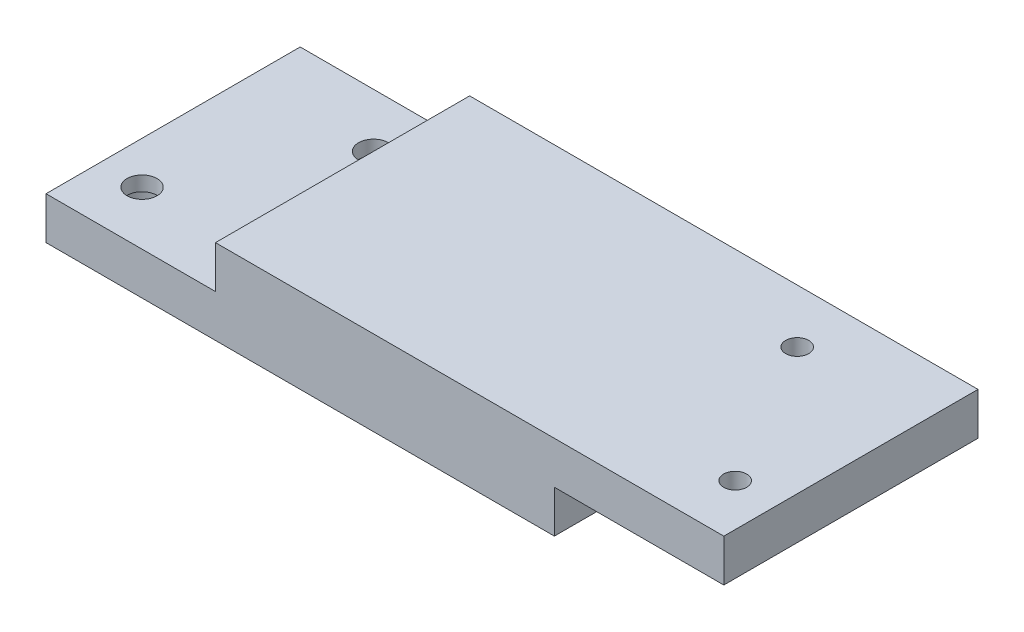
ISO-10303-21;
HEADER;
FILE_DESCRIPTION(('STEP AP214'),'2;1');
FILE_NAME('part.step','',(''),(''),'','','');
FILE_SCHEMA(('AUTOMOTIVE_DESIGN { 1 0 10303 214 1 1 1 1 }'));
ENDSEC;
DATA;
#1=APPLICATION_CONTEXT('core data for automotive mechanical design processes');
#2=APPLICATION_PROTOCOL_DEFINITION('international standard','automotive_design',2000,#1);
#3=PRODUCT_CONTEXT('',#1,'mechanical');
#4=PRODUCT('Part','Part','',(#3));
#5=PRODUCT_RELATED_PRODUCT_CATEGORY('part','',(#4));
#6=PRODUCT_DEFINITION_FORMATION('','',#4);
#7=PRODUCT_DEFINITION_CONTEXT('part definition',#1,'design');
#8=PRODUCT_DEFINITION('design','',#6,#7);
#9=PRODUCT_DEFINITION_SHAPE('','',#8);
#10=(LENGTH_UNIT() NAMED_UNIT(*) SI_UNIT(.MILLI.,.METRE.));
#11=(NAMED_UNIT(*) PLANE_ANGLE_UNIT() SI_UNIT($,.RADIAN.));
#12=(NAMED_UNIT(*) SI_UNIT($,.STERADIAN.) SOLID_ANGLE_UNIT());
#13=UNCERTAINTY_MEASURE_WITH_UNIT(LENGTH_MEASURE(1.E-05),#10,'distance_accuracy_value','');
#14=(GEOMETRIC_REPRESENTATION_CONTEXT(3) GLOBAL_UNCERTAINTY_ASSIGNED_CONTEXT((#13)) GLOBAL_UNIT_ASSIGNED_CONTEXT((#10,
#11,#12)) REPRESENTATION_CONTEXT('',''));
#15=CARTESIAN_POINT('',(0.,0.,0.));
#16=DIRECTION('',(0.,0.,1.));
#17=DIRECTION('',(1.,0.,0.));
#18=AXIS2_PLACEMENT_3D('',#15,#16,#17);
#19=CARTESIAN_POINT('',(0.,-6.35,0.));
#20=DIRECTION('',(0.,1.,0.));
#21=DIRECTION('',(0.,0.,1.));
#22=AXIS2_PLACEMENT_3D('',#19,#20,#21);
#23=PLANE('',#22);
#24=CARTESIAN_POINT('',(-44.45,-6.35,10.9985226280624));
#25=DIRECTION('',(0.,-1.,0.));
#26=DIRECTION('',(0.,0.,-1.));
#27=AXIS2_PLACEMENT_3D('',#24,#25,#26);
#28=CIRCLE('',#27,3.96875);
#29=CARTESIAN_POINT('',(-44.45,-6.35,7.02977262806239));
#30=VERTEX_POINT('',#29);
#31=EDGE_CURVE('E252',#30,#30,#28,.T.);
#32=ORIENTED_EDGE('',*,*,#31,.F.);
#33=EDGE_LOOP('',(#32));
#34=FACE_BOUND('',#33,.T.);
#35=DIRECTION('',(1.,0.,0.));
#36=VECTOR('',#35,1.);
#37=CARTESIAN_POINT('',(0.,-6.35,19.05));
#38=LINE('',#37,#36);
#39=CARTESIAN_POINT('',(-50.8,-6.35,19.05));
#40=VERTEX_POINT('',#39);
#41=CARTESIAN_POINT('',(25.4,-6.35,19.05));
#42=VERTEX_POINT('',#41);
#43=EDGE_CURVE('E177',#40,#42,#38,.T.);
#44=ORIENTED_EDGE('',*,*,#43,.F.);
#45=DIRECTION('',(0.,0.,1.));
#46=VECTOR('',#45,1.);
#47=CARTESIAN_POINT('',(-50.8,-6.35,0.));
#48=LINE('',#47,#46);
#49=CARTESIAN_POINT('',(-50.8,-6.35,-19.05));
#50=VERTEX_POINT('',#49);
#51=EDGE_CURVE('E186',#50,#40,#48,.T.);
#52=ORIENTED_EDGE('',*,*,#51,.F.);
#53=DIRECTION('',(1.,0.,0.));
#54=VECTOR('',#53,1.);
#55=CARTESIAN_POINT('',(0.,-6.35,-19.05));
#56=LINE('',#55,#54);
#57=CARTESIAN_POINT('',(25.4,-6.35,-19.05));
#58=VERTEX_POINT('',#57);
#59=EDGE_CURVE('E183',#50,#58,#56,.T.);
#60=ORIENTED_EDGE('',*,*,#59,.T.);
#61=DIRECTION('',(0.,0.,1.));
#62=VECTOR('',#61,1.);
#63=CARTESIAN_POINT('',(25.4,-6.35,0.));
#64=LINE('',#63,#62);
#65=EDGE_CURVE('E97',#58,#42,#64,.T.);
#66=ORIENTED_EDGE('',*,*,#65,.T.);
#67=EDGE_LOOP('',(#44,#52,#60,#66));
#68=FACE_BOUND('',#67,.T.);
#69=CARTESIAN_POINT('',(-31.7500000000001,-6.35,-10.9985226280624));
#70=DIRECTION('',(0.,-1.,0.));
#71=DIRECTION('',(0.,0.,-1.));
#72=AXIS2_PLACEMENT_3D('',#69,#70,#71);
#73=CIRCLE('',#72,3.96875);
#74=CARTESIAN_POINT('',(-31.7500000000001,-6.35,-14.9672726280624));
#75=VERTEX_POINT('',#74);
#76=EDGE_CURVE('E228',#75,#75,#73,.T.);
#77=ORIENTED_EDGE('',*,*,#76,.F.);
#78=EDGE_LOOP('',(#77));
#79=FACE_BOUND('',#78,.T.);
#80=ADVANCED_FACE('F46',(#34,#68,#79),#23,.F.);
#81=CARTESIAN_POINT('',(0.,-6.35,19.05));
#82=DIRECTION('',(0.,0.,1.));
#83=DIRECTION('',(1.,0.,0.));
#84=AXIS2_PLACEMENT_3D('',#81,#82,#83);
#85=PLANE('',#84);
#86=DIRECTION('',(1.,0.,0.));
#87=VECTOR('',#86,1.);
#88=CARTESIAN_POINT('',(0.,0.,19.05));
#89=LINE('',#88,#87);
#90=CARTESIAN_POINT('',(-50.8,0.,19.05));
#91=VERTEX_POINT('',#90);
#92=CARTESIAN_POINT('',(-25.4,0.,19.05));
#93=VERTEX_POINT('',#92);
#94=EDGE_CURVE('E142',#91,#93,#89,.T.);
#95=ORIENTED_EDGE('',*,*,#94,.F.);
#96=DIRECTION('',(0.,1.,0.));
#97=VECTOR('',#96,1.);
#98=CARTESIAN_POINT('',(-50.8,-6.35,19.05));
#99=LINE('',#98,#97);
#100=EDGE_CURVE('E11',#40,#91,#99,.T.);
#101=ORIENTED_EDGE('',*,*,#100,.F.);
#102=ORIENTED_EDGE('',*,*,#43,.T.);
#103=DIRECTION('',(0.,1.,0.));
#104=VECTOR('',#103,1.);
#105=CARTESIAN_POINT('',(25.4,-6.35,19.05));
#106=LINE('',#105,#104);
#107=CARTESIAN_POINT('',(25.4,0.,19.05));
#108=VERTEX_POINT('',#107);
#109=EDGE_CURVE('E50',#42,#108,#106,.T.);
#110=ORIENTED_EDGE('',*,*,#109,.T.);
#111=DIRECTION('',(1.,0.,0.));
#112=VECTOR('',#111,1.);
#113=CARTESIAN_POINT('',(0.,0.,19.05));
#114=LINE('',#113,#112);
#115=CARTESIAN_POINT('',(50.8,0.,19.05));
#116=VERTEX_POINT('',#115);
#117=EDGE_CURVE('E137',#108,#116,#114,.T.);
#118=ORIENTED_EDGE('',*,*,#117,.T.);
#119=DIRECTION('',(0.,-1.,0.));
#120=VECTOR('',#119,1.);
#121=CARTESIAN_POINT('',(50.8,6.35,19.05));
#122=LINE('',#121,#120);
#123=CARTESIAN_POINT('',(50.8,6.35,19.05));
#124=VERTEX_POINT('',#123);
#125=EDGE_CURVE('E135',#124,#116,#122,.T.);
#126=ORIENTED_EDGE('',*,*,#125,.F.);
#127=DIRECTION('',(1.,0.,0.));
#128=VECTOR('',#127,1.);
#129=CARTESIAN_POINT('',(0.,6.35,19.05));
#130=LINE('',#129,#128);
#131=CARTESIAN_POINT('',(-25.4,6.35,19.05));
#132=VERTEX_POINT('',#131);
#133=EDGE_CURVE('E121',#132,#124,#130,.T.);
#134=ORIENTED_EDGE('',*,*,#133,.F.);
#135=DIRECTION('',(0.,-1.,0.));
#136=VECTOR('',#135,1.);
#137=CARTESIAN_POINT('',(-25.4,6.35,19.05));
#138=LINE('',#137,#136);
#139=EDGE_CURVE('E157',#132,#93,#138,.T.);
#140=ORIENTED_EDGE('',*,*,#139,.T.);
#141=EDGE_LOOP('',(#95,#101,#102,#110,#118,#126,#134,#140));
#142=FACE_BOUND('',#141,.T.);
#143=ADVANCED_FACE('F48',(#142),#85,.T.);
#144=CARTESIAN_POINT('',(-50.8,-6.35,0.));
#145=DIRECTION('',(-1.,0.,0.));
#146=DIRECTION('',(0.,0.,1.));
#147=AXIS2_PLACEMENT_3D('',#144,#145,#146);
#148=PLANE('',#147);
#149=DIRECTION('',(0.,0.,1.));
#150=VECTOR('',#149,1.);
#151=CARTESIAN_POINT('',(-50.8,0.,0.));
#152=LINE('',#151,#150);
#153=CARTESIAN_POINT('',(-50.8,0.,-19.05));
#154=VERTEX_POINT('',#153);
#155=EDGE_CURVE('E180',#154,#91,#152,.T.);
#156=ORIENTED_EDGE('',*,*,#155,.F.);
#157=DIRECTION('',(0.,1.,0.));
#158=VECTOR('',#157,1.);
#159=CARTESIAN_POINT('',(-50.8,-6.35,-19.05));
#160=LINE('',#159,#158);
#161=EDGE_CURVE('E56',#50,#154,#160,.T.);
#162=ORIENTED_EDGE('',*,*,#161,.F.);
#163=ORIENTED_EDGE('',*,*,#51,.T.);
#164=ORIENTED_EDGE('',*,*,#100,.T.);
#165=EDGE_LOOP('',(#156,#162,#163,#164));
#166=FACE_BOUND('',#165,.T.);
#167=ADVANCED_FACE('F219',(#166),#148,.T.);
#168=CARTESIAN_POINT('',(0.,-6.35,-19.05));
#169=DIRECTION('',(0.,0.,1.));
#170=DIRECTION('',(1.,0.,0.));
#171=AXIS2_PLACEMENT_3D('',#168,#169,#170);
#172=PLANE('',#171);
#173=DIRECTION('',(1.,0.,0.));
#174=VECTOR('',#173,1.);
#175=CARTESIAN_POINT('',(0.,0.,-19.05));
#176=LINE('',#175,#174);
#177=CARTESIAN_POINT('',(-25.4,0.,-19.05));
#178=VERTEX_POINT('',#177);
#179=EDGE_CURVE('E195',#154,#178,#176,.T.);
#180=ORIENTED_EDGE('',*,*,#179,.T.);
#181=DIRECTION('',(0.,-1.,0.));
#182=VECTOR('',#181,1.);
#183=CARTESIAN_POINT('',(-25.4,6.35,-19.05));
#184=LINE('',#183,#182);
#185=CARTESIAN_POINT('',(-25.4,6.35,-19.05));
#186=VERTEX_POINT('',#185);
#187=EDGE_CURVE('E171',#186,#178,#184,.T.);
#188=ORIENTED_EDGE('',*,*,#187,.F.);
#189=DIRECTION('',(1.,0.,0.));
#190=VECTOR('',#189,1.);
#191=CARTESIAN_POINT('',(0.,6.35,-19.05));
#192=LINE('',#191,#190);
#193=CARTESIAN_POINT('',(50.8,6.35,-19.05));
#194=VERTEX_POINT('',#193);
#195=EDGE_CURVE('E148',#186,#194,#192,.T.);
#196=ORIENTED_EDGE('',*,*,#195,.T.);
#197=DIRECTION('',(0.,-1.,0.));
#198=VECTOR('',#197,1.);
#199=CARTESIAN_POINT('',(50.8,6.35,-19.05));
#200=LINE('',#199,#198);
#201=CARTESIAN_POINT('',(50.8,0.,-19.05));
#202=VERTEX_POINT('',#201);
#203=EDGE_CURVE('E143',#194,#202,#200,.T.);
#204=ORIENTED_EDGE('',*,*,#203,.T.);
#205=DIRECTION('',(1.,0.,0.));
#206=VECTOR('',#205,1.);
#207=CARTESIAN_POINT('',(0.,0.,-19.05));
#208=LINE('',#207,#206);
#209=CARTESIAN_POINT('',(25.4,0.,-19.05));
#210=VERTEX_POINT('',#209);
#211=EDGE_CURVE('E164',#210,#202,#208,.T.);
#212=ORIENTED_EDGE('',*,*,#211,.F.);
#213=DIRECTION('',(0.,1.,0.));
#214=VECTOR('',#213,1.);
#215=CARTESIAN_POINT('',(25.4,-6.35,-19.05));
#216=LINE('',#215,#214);
#217=EDGE_CURVE('E202',#58,#210,#216,.T.);
#218=ORIENTED_EDGE('',*,*,#217,.F.);
#219=ORIENTED_EDGE('',*,*,#59,.F.);
#220=ORIENTED_EDGE('',*,*,#161,.T.);
#221=EDGE_LOOP('',(#180,#188,#196,#204,#212,#218,#219,#220));
#222=FACE_BOUND('',#221,.T.);
#223=ADVANCED_FACE('F215',(#222),#172,.F.);
#224=CARTESIAN_POINT('',(25.4,-6.35,0.));
#225=DIRECTION('',(-1.,0.,0.));
#226=DIRECTION('',(0.,0.,1.));
#227=AXIS2_PLACEMENT_3D('',#224,#225,#226);
#228=PLANE('',#227);
#229=DIRECTION('',(0.,0.,1.));
#230=VECTOR('',#229,1.);
#231=CARTESIAN_POINT('',(25.4,0.,0.));
#232=LINE('',#231,#230);
#233=EDGE_CURVE('E191',#210,#108,#232,.T.);
#234=ORIENTED_EDGE('',*,*,#233,.T.);
#235=ORIENTED_EDGE('',*,*,#109,.F.);
#236=ORIENTED_EDGE('',*,*,#65,.F.);
#237=ORIENTED_EDGE('',*,*,#217,.T.);
#238=EDGE_LOOP('',(#234,#235,#236,#237));
#239=FACE_BOUND('',#238,.T.);
#240=ADVANCED_FACE('F210',(#239),#228,.F.);
#241=CARTESIAN_POINT('',(0.,0.,0.));
#242=DIRECTION('',(0.,1.,0.));
#243=DIRECTION('',(0.,0.,1.));
#244=AXIS2_PLACEMENT_3D('',#241,#242,#243);
#245=PLANE('',#244);
#246=CARTESIAN_POINT('',(-31.7500000000001,0.,-10.9985226280624));
#247=DIRECTION('',(0.,1.,0.));
#248=DIRECTION('',(0.,0.,1.));
#249=AXIS2_PLACEMENT_3D('',#246,#247,#248);
#250=CIRCLE('',#249,2.2479);
#251=CARTESIAN_POINT('',(-31.7500000000001,0.,-8.75062262806239));
#252=VERTEX_POINT('',#251);
#253=EDGE_CURVE('E248',#252,#252,#250,.T.);
#254=ORIENTED_EDGE('',*,*,#253,.F.);
#255=EDGE_LOOP('',(#254));
#256=FACE_BOUND('',#255,.T.);
#257=CARTESIAN_POINT('',(-44.45,0.,10.9985226280624));
#258=DIRECTION('',(0.,1.,0.));
#259=DIRECTION('',(0.,0.,1.));
#260=AXIS2_PLACEMENT_3D('',#257,#258,#259);
#261=CIRCLE('',#260,2.2479);
#262=CARTESIAN_POINT('',(-44.45,0.,13.2464226280624));
#263=VERTEX_POINT('',#262);
#264=EDGE_CURVE('E161',#263,#263,#261,.T.);
#265=ORIENTED_EDGE('',*,*,#264,.F.);
#266=EDGE_LOOP('',(#265));
#267=FACE_BOUND('',#266,.T.);
#268=DIRECTION('',(0.,0.,1.));
#269=VECTOR('',#268,1.);
#270=CARTESIAN_POINT('',(-25.4,0.,0.));
#271=LINE('',#270,#269);
#272=EDGE_CURVE('E64',#178,#93,#271,.T.);
#273=ORIENTED_EDGE('',*,*,#272,.F.);
#274=ORIENTED_EDGE('',*,*,#179,.F.);
#275=ORIENTED_EDGE('',*,*,#155,.T.);
#276=ORIENTED_EDGE('',*,*,#94,.T.);
#277=EDGE_LOOP('',(#273,#274,#275,#276));
#278=FACE_BOUND('',#277,.T.);
#279=ADVANCED_FACE('F218',(#256,#267,#278),#245,.T.);
#280=CARTESIAN_POINT('',(50.8,6.35,0.));
#281=DIRECTION('',(1.,0.,0.));
#282=DIRECTION('',(0.,0.,-1.));
#283=AXIS2_PLACEMENT_3D('',#280,#281,#282);
#284=PLANE('',#283);
#285=DIRECTION('',(0.,0.,1.));
#286=VECTOR('',#285,1.);
#287=CARTESIAN_POINT('',(50.8,0.,0.));
#288=LINE('',#287,#286);
#289=EDGE_CURVE('E160',#202,#116,#288,.T.);
#290=ORIENTED_EDGE('',*,*,#289,.F.);
#291=ORIENTED_EDGE('',*,*,#203,.F.);
#292=DIRECTION('',(0.,0.,1.));
#293=VECTOR('',#292,1.);
#294=CARTESIAN_POINT('',(50.8,6.35,0.));
#295=LINE('',#294,#293);
#296=EDGE_CURVE('E126',#194,#124,#295,.T.);
#297=ORIENTED_EDGE('',*,*,#296,.T.);
#298=ORIENTED_EDGE('',*,*,#125,.T.);
#299=EDGE_LOOP('',(#290,#291,#297,#298));
#300=FACE_BOUND('',#299,.T.);
#301=ADVANCED_FACE('F145',(#300),#284,.T.);
#302=CARTESIAN_POINT('',(-25.4,6.35,0.));
#303=DIRECTION('',(1.,0.,0.));
#304=DIRECTION('',(0.,0.,-1.));
#305=AXIS2_PLACEMENT_3D('',#302,#303,#304);
#306=PLANE('',#305);
#307=ORIENTED_EDGE('',*,*,#272,.T.);
#308=ORIENTED_EDGE('',*,*,#139,.F.);
#309=DIRECTION('',(0.,0.,1.));
#310=VECTOR('',#309,1.);
#311=CARTESIAN_POINT('',(-25.4,6.35,0.));
#312=LINE('',#311,#310);
#313=EDGE_CURVE('E129',#186,#132,#312,.T.);
#314=ORIENTED_EDGE('',*,*,#313,.F.);
#315=ORIENTED_EDGE('',*,*,#187,.T.);
#316=EDGE_LOOP('',(#307,#308,#314,#315));
#317=FACE_BOUND('',#316,.T.);
#318=ADVANCED_FACE('F217',(#317),#306,.F.);
#319=CARTESIAN_POINT('',(0.,6.35,0.));
#320=DIRECTION('',(0.,1.,0.));
#321=DIRECTION('',(0.,0.,1.));
#322=AXIS2_PLACEMENT_3D('',#319,#320,#321);
#323=PLANE('',#322);
#324=CARTESIAN_POINT('',(31.75,6.34999999999999,-10.9985226280624));
#325=DIRECTION('',(0.,-1.,0.));
#326=DIRECTION('',(0.,0.,-1.));
#327=AXIS2_PLACEMENT_3D('',#324,#325,#326);
#328=CIRCLE('',#327,1.72719999999998);
#329=CARTESIAN_POINT('',(31.75,6.34999999999999,-12.7257226280624));
#330=VERTEX_POINT('',#329);
#331=EDGE_CURVE('E463',#330,#330,#328,.T.);
#332=ORIENTED_EDGE('',*,*,#331,.T.);
#333=EDGE_LOOP('',(#332));
#334=FACE_BOUND('',#333,.T.);
#335=CARTESIAN_POINT('',(44.45,6.34999999999999,10.9985226280624));
#336=DIRECTION('',(0.,-1.,0.));
#337=DIRECTION('',(0.,0.,-1.));
#338=AXIS2_PLACEMENT_3D('',#335,#336,#337);
#339=CIRCLE('',#338,1.72719999999998);
#340=CARTESIAN_POINT('',(44.45,6.34999999999999,9.27132262806241));
#341=VERTEX_POINT('',#340);
#342=EDGE_CURVE('E232',#341,#341,#339,.T.);
#343=ORIENTED_EDGE('',*,*,#342,.T.);
#344=EDGE_LOOP('',(#343));
#345=FACE_BOUND('',#344,.T.);
#346=ORIENTED_EDGE('',*,*,#133,.T.);
#347=ORIENTED_EDGE('',*,*,#296,.F.);
#348=ORIENTED_EDGE('',*,*,#195,.F.);
#349=ORIENTED_EDGE('',*,*,#313,.T.);
#350=EDGE_LOOP('',(#346,#347,#348,#349));
#351=FACE_BOUND('',#350,.T.);
#352=ADVANCED_FACE('F123',(#334,#345,#351),#323,.T.);
#353=CARTESIAN_POINT('',(0.,0.,0.));
#354=DIRECTION('',(0.,1.,0.));
#355=DIRECTION('',(0.,0.,1.));
#356=AXIS2_PLACEMENT_3D('',#353,#354,#355);
#357=PLANE('',#356);
#358=CARTESIAN_POINT('',(31.75,0.,-10.9985226280624));
#359=DIRECTION('',(0.,-1.,0.));
#360=DIRECTION('',(0.,0.,-1.));
#361=AXIS2_PLACEMENT_3D('',#358,#359,#360);
#362=CIRCLE('',#361,1.72719999999999);
#363=CARTESIAN_POINT('',(31.75,0.,-12.7257226280624));
#364=VERTEX_POINT('',#363);
#365=EDGE_CURVE('E466',#364,#364,#362,.T.);
#366=ORIENTED_EDGE('',*,*,#365,.F.);
#367=EDGE_LOOP('',(#366));
#368=FACE_BOUND('',#367,.T.);
#369=CARTESIAN_POINT('',(44.45,0.,10.9985226280624));
#370=DIRECTION('',(0.,-1.,0.));
#371=DIRECTION('',(0.,0.,-1.));
#372=AXIS2_PLACEMENT_3D('',#369,#370,#371);
#373=CIRCLE('',#372,1.72719999999999);
#374=CARTESIAN_POINT('',(44.45,0.,9.2713226280624));
#375=VERTEX_POINT('',#374);
#376=EDGE_CURVE('E241',#375,#375,#373,.T.);
#377=ORIENTED_EDGE('',*,*,#376,.F.);
#378=EDGE_LOOP('',(#377));
#379=FACE_BOUND('',#378,.T.);
#380=ORIENTED_EDGE('',*,*,#233,.F.);
#381=ORIENTED_EDGE('',*,*,#211,.T.);
#382=ORIENTED_EDGE('',*,*,#289,.T.);
#383=ORIENTED_EDGE('',*,*,#117,.F.);
#384=EDGE_LOOP('',(#380,#381,#382,#383));
#385=FACE_BOUND('',#384,.T.);
#386=ADVANCED_FACE('F213',(#368,#379,#385),#357,.F.);
#387=CARTESIAN_POINT('',(-44.45,-6.35,10.9985226280624));
#388=DIRECTION('',(0.,-1.,0.));
#389=DIRECTION('',(0.,0.,-1.));
#390=AXIS2_PLACEMENT_3D('',#387,#388,#389);
#391=CYLINDRICAL_SURFACE('',#390,2.2479);
#392=CARTESIAN_POINT('',(-44.45,-2.1844,10.9985226280624));
#393=DIRECTION('',(0.,-1.,0.));
#394=DIRECTION('',(0.,0.,-1.));
#395=AXIS2_PLACEMENT_3D('',#392,#393,#394);
#396=CIRCLE('',#395,2.2479);
#397=CARTESIAN_POINT('',(-44.45,-2.1844,8.75062262806239));
#398=VERTEX_POINT('',#397);
#399=EDGE_CURVE('E260',#398,#398,#396,.T.);
#400=ORIENTED_EDGE('',*,*,#399,.T.);
#401=EDGE_LOOP('',(#400));
#402=FACE_BOUND('',#401,.T.);
#403=ORIENTED_EDGE('',*,*,#264,.T.);
#404=EDGE_LOOP('',(#403));
#405=FACE_BOUND('',#404,.T.);
#406=ADVANCED_FACE('F268',(#402,#405),#391,.F.);
#407=CARTESIAN_POINT('',(-42.2021,-2.1844,10.9985226280624));
#408=DIRECTION('',(0.,1.,0.));
#409=DIRECTION('',(0.,0.,1.));
#410=AXIS2_PLACEMENT_3D('',#407,#408,#409);
#411=PLANE('',#410);
#412=ORIENTED_EDGE('',*,*,#399,.F.);
#413=EDGE_LOOP('',(#412));
#414=FACE_BOUND('',#413,.T.);
#415=CARTESIAN_POINT('',(-44.45,-2.1844,10.9985226280624));
#416=DIRECTION('',(0.,-1.,0.));
#417=DIRECTION('',(0.,0.,-1.));
#418=AXIS2_PLACEMENT_3D('',#415,#416,#417);
#419=CIRCLE('',#418,3.96875);
#420=CARTESIAN_POINT('',(-44.45,-2.1844,7.02977262806239));
#421=VERTEX_POINT('',#420);
#422=EDGE_CURVE('E256',#421,#421,#419,.T.);
#423=ORIENTED_EDGE('',*,*,#422,.T.);
#424=EDGE_LOOP('',(#423));
#425=FACE_BOUND('',#424,.T.);
#426=ADVANCED_FACE('F341',(#414,#425),#411,.F.);
#427=CARTESIAN_POINT('',(-44.45,-6.35,10.9985226280624));
#428=DIRECTION('',(0.,-1.,0.));
#429=DIRECTION('',(0.,0.,-1.));
#430=AXIS2_PLACEMENT_3D('',#427,#428,#429);
#431=CYLINDRICAL_SURFACE('',#430,3.96875);
#432=ORIENTED_EDGE('',*,*,#422,.F.);
#433=EDGE_LOOP('',(#432));
#434=FACE_BOUND('',#433,.T.);
#435=ORIENTED_EDGE('',*,*,#31,.T.);
#436=EDGE_LOOP('',(#435));
#437=FACE_BOUND('',#436,.T.);
#438=ADVANCED_FACE('F352',(#434,#437),#431,.F.);
#439=CARTESIAN_POINT('',(-31.7500000000001,-6.35,-10.9985226280624));
#440=DIRECTION('',(0.,-1.,0.));
#441=DIRECTION('',(0.,0.,-1.));
#442=AXIS2_PLACEMENT_3D('',#439,#440,#441);
#443=CYLINDRICAL_SURFACE('',#442,2.2479);
#444=CARTESIAN_POINT('',(-31.7500000000001,-2.1844,-10.9985226280624));
#445=DIRECTION('',(0.,-1.,0.));
#446=DIRECTION('',(0.,0.,-1.));
#447=AXIS2_PLACEMENT_3D('',#444,#445,#446);
#448=CIRCLE('',#447,2.2479);
#449=CARTESIAN_POINT('',(-31.7500000000001,-2.1844,-13.2464226280624));
#450=VERTEX_POINT('',#449);
#451=EDGE_CURVE('E238',#450,#450,#448,.T.);
#452=ORIENTED_EDGE('',*,*,#451,.T.);
#453=EDGE_LOOP('',(#452));
#454=FACE_BOUND('',#453,.T.);
#455=ORIENTED_EDGE('',*,*,#253,.T.);
#456=EDGE_LOOP('',(#455));
#457=FACE_BOUND('',#456,.T.);
#458=ADVANCED_FACE('F363',(#454,#457),#443,.F.);
#459=CARTESIAN_POINT('',(-29.5021000000001,-2.1844,-10.9985226280624));
#460=DIRECTION('',(0.,1.,0.));
#461=DIRECTION('',(0.,0.,1.));
#462=AXIS2_PLACEMENT_3D('',#459,#460,#461);
#463=PLANE('',#462);
#464=ORIENTED_EDGE('',*,*,#451,.F.);
#465=EDGE_LOOP('',(#464));
#466=FACE_BOUND('',#465,.T.);
#467=CARTESIAN_POINT('',(-31.7500000000001,-2.1844,-10.9985226280624));
#468=DIRECTION('',(0.,-1.,0.));
#469=DIRECTION('',(0.,0.,-1.));
#470=AXIS2_PLACEMENT_3D('',#467,#468,#469);
#471=CIRCLE('',#470,3.96875);
#472=CARTESIAN_POINT('',(-31.7500000000001,-2.1844,-14.9672726280624));
#473=VERTEX_POINT('',#472);
#474=EDGE_CURVE('E231',#473,#473,#471,.T.);
#475=ORIENTED_EDGE('',*,*,#474,.T.);
#476=EDGE_LOOP('',(#475));
#477=FACE_BOUND('',#476,.T.);
#478=ADVANCED_FACE('F374',(#466,#477),#463,.F.);
#479=CARTESIAN_POINT('',(-31.7500000000001,-6.35,-10.9985226280624));
#480=DIRECTION('',(0.,-1.,0.));
#481=DIRECTION('',(0.,0.,-1.));
#482=AXIS2_PLACEMENT_3D('',#479,#480,#481);
#483=CYLINDRICAL_SURFACE('',#482,3.96875);
#484=ORIENTED_EDGE('',*,*,#474,.F.);
#485=EDGE_LOOP('',(#484));
#486=FACE_BOUND('',#485,.T.);
#487=ORIENTED_EDGE('',*,*,#76,.T.);
#488=EDGE_LOOP('',(#487));
#489=FACE_BOUND('',#488,.T.);
#490=ADVANCED_FACE('F385',(#486,#489),#483,.F.);
#491=CARTESIAN_POINT('',(44.45,0.,10.9985226280624));
#492=DIRECTION('',(0.,-1.,0.));
#493=DIRECTION('',(0.,0.,-1.));
#494=AXIS2_PLACEMENT_3D('',#491,#492,#493);
#495=CYLINDRICAL_SURFACE('',#494,1.72719999999999);
#496=ORIENTED_EDGE('',*,*,#342,.F.);
#497=EDGE_LOOP('',(#496));
#498=FACE_BOUND('',#497,.T.);
#499=ORIENTED_EDGE('',*,*,#376,.T.);
#500=EDGE_LOOP('',(#499));
#501=FACE_BOUND('',#500,.T.);
#502=ADVANCED_FACE('F396',(#498,#501),#495,.F.);
#503=CARTESIAN_POINT('',(31.75,0.,-10.9985226280624));
#504=DIRECTION('',(0.,-1.,0.));
#505=DIRECTION('',(0.,0.,-1.));
#506=AXIS2_PLACEMENT_3D('',#503,#504,#505);
#507=CYLINDRICAL_SURFACE('',#506,1.72719999999999);
#508=ORIENTED_EDGE('',*,*,#331,.F.);
#509=EDGE_LOOP('',(#508));
#510=FACE_BOUND('',#509,.T.);
#511=ORIENTED_EDGE('',*,*,#365,.T.);
#512=EDGE_LOOP('',(#511));
#513=FACE_BOUND('',#512,.T.);
#514=ADVANCED_FACE('F428',(#510,#513),#507,.F.);
#515=CLOSED_SHELL('',(#80,#143,#167,#223,#240,#279,#301,#318,#352,#386,#406,#426,#438,#458,#478,
#490,#502,#514));
#516=MANIFOLD_SOLID_BREP('B2',#515);
#517=ADVANCED_BREP_SHAPE_REPRESENTATION('',(#18,#516),#14);
#518=SHAPE_DEFINITION_REPRESENTATION(#9,#517);
ENDSEC;
END-ISO-10303-21;
